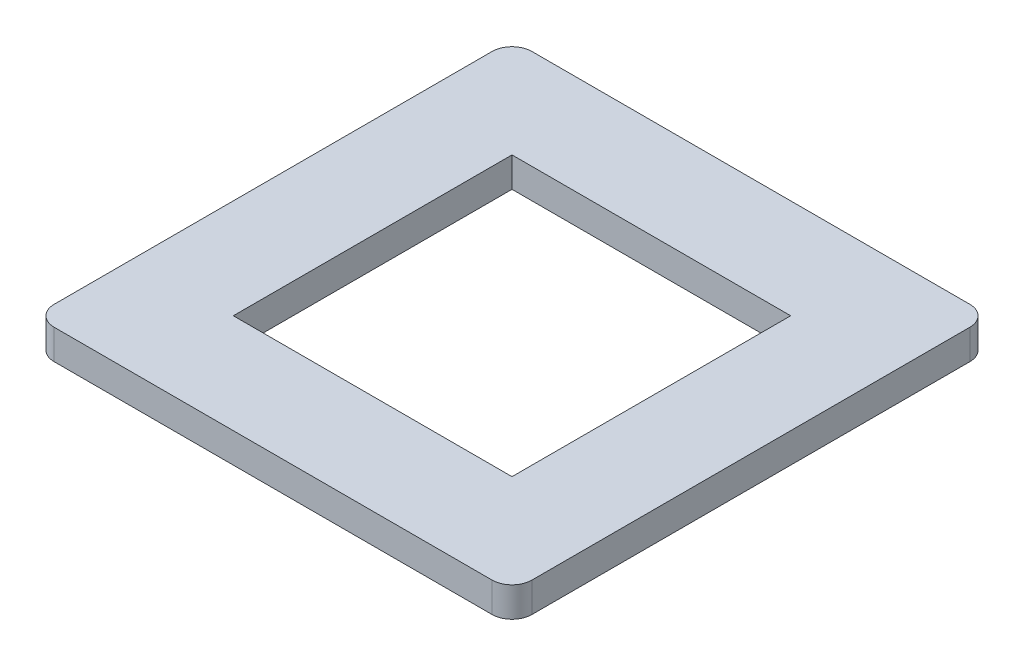
ISO-10303-21;
HEADER;
FILE_DESCRIPTION(('STEP AP214'),'2;1');
FILE_NAME('part.step','',(''),(''),'','','');
FILE_SCHEMA(('AUTOMOTIVE_DESIGN { 1 0 10303 214 1 1 1 1 }'));
ENDSEC;
DATA;
#1=APPLICATION_CONTEXT('core data for automotive mechanical design processes');
#2=APPLICATION_PROTOCOL_DEFINITION('international standard','automotive_design',2000,#1);
#3=PRODUCT_CONTEXT('',#1,'mechanical');
#4=PRODUCT('Part','Part','',(#3));
#5=PRODUCT_RELATED_PRODUCT_CATEGORY('part','',(#4));
#6=PRODUCT_DEFINITION_FORMATION('','',#4);
#7=PRODUCT_DEFINITION_CONTEXT('part definition',#1,'design');
#8=PRODUCT_DEFINITION('design','',#6,#7);
#9=PRODUCT_DEFINITION_SHAPE('','',#8);
#10=(LENGTH_UNIT() NAMED_UNIT(*) SI_UNIT(.MILLI.,.METRE.));
#11=(NAMED_UNIT(*) PLANE_ANGLE_UNIT() SI_UNIT($,.RADIAN.));
#12=(NAMED_UNIT(*) SI_UNIT($,.STERADIAN.) SOLID_ANGLE_UNIT());
#13=UNCERTAINTY_MEASURE_WITH_UNIT(LENGTH_MEASURE(1.E-05),#10,'distance_accuracy_value','');
#14=(GEOMETRIC_REPRESENTATION_CONTEXT(3) GLOBAL_UNCERTAINTY_ASSIGNED_CONTEXT((#13)) GLOBAL_UNIT_ASSIGNED_CONTEXT((#10,
#11,#12)) REPRESENTATION_CONTEXT('',''));
#15=CARTESIAN_POINT('',(0.,0.,0.));
#16=DIRECTION('',(0.,0.,1.));
#17=DIRECTION('',(1.,0.,0.));
#18=AXIS2_PLACEMENT_3D('',#15,#16,#17);
#19=CARTESIAN_POINT('',(0.,1.5,0.));
#20=DIRECTION('',(0.,1.,0.));
#21=DIRECTION('',(0.,0.,1.));
#22=AXIS2_PLACEMENT_3D('',#19,#20,#21);
#23=PLANE('',#22);
#24=DIRECTION('',(1.,0.,0.));
#25=VECTOR('',#24,1.);
#26=CARTESIAN_POINT('',(-12.,1.5,12.));
#27=LINE('',#26,#25);
#28=CARTESIAN_POINT('',(-11.,1.5,12.));
#29=VERTEX_POINT('',#28);
#30=CARTESIAN_POINT('',(11.,1.5,12.));
#31=VERTEX_POINT('',#30);
#32=EDGE_CURVE('E191',#29,#31,#27,.T.);
#33=ORIENTED_EDGE('',*,*,#32,.T.);
#34=CARTESIAN_POINT('',(11.,1.5,11.));
#35=DIRECTION('',(0.,1.,0.));
#36=DIRECTION('',(0.,0.,1.));
#37=AXIS2_PLACEMENT_3D('',#34,#35,#36);
#38=CIRCLE('',#37,1.);
#39=CARTESIAN_POINT('',(12.,1.5,11.));
#40=VERTEX_POINT('',#39);
#41=EDGE_CURVE('E205',#31,#40,#38,.T.);
#42=ORIENTED_EDGE('',*,*,#41,.T.);
#43=DIRECTION('',(0.,0.,-1.));
#44=VECTOR('',#43,1.);
#45=CARTESIAN_POINT('',(12.,1.5,12.));
#46=LINE('',#45,#44);
#47=CARTESIAN_POINT('',(12.,1.5,-11.));
#48=VERTEX_POINT('',#47);
#49=EDGE_CURVE('E196',#40,#48,#46,.T.);
#50=ORIENTED_EDGE('',*,*,#49,.T.);
#51=CARTESIAN_POINT('',(11.,1.5,-11.));
#52=DIRECTION('',(0.,1.,0.));
#53=DIRECTION('',(0.,0.,1.));
#54=AXIS2_PLACEMENT_3D('',#51,#52,#53);
#55=CIRCLE('',#54,1.);
#56=CARTESIAN_POINT('',(11.,1.5,-12.));
#57=VERTEX_POINT('',#56);
#58=EDGE_CURVE('E211',#48,#57,#55,.T.);
#59=ORIENTED_EDGE('',*,*,#58,.T.);
#60=DIRECTION('',(-1.,0.,0.));
#61=VECTOR('',#60,1.);
#62=CARTESIAN_POINT('',(-12.,1.5,-12.));
#63=LINE('',#62,#61);
#64=CARTESIAN_POINT('',(-11.,1.5,-12.));
#65=VERTEX_POINT('',#64);
#66=EDGE_CURVE('E225',#57,#65,#63,.T.);
#67=ORIENTED_EDGE('',*,*,#66,.T.);
#68=CARTESIAN_POINT('',(-11.,1.5,-11.));
#69=DIRECTION('',(0.,1.,0.));
#70=DIRECTION('',(0.,0.,1.));
#71=AXIS2_PLACEMENT_3D('',#68,#69,#70);
#72=CIRCLE('',#71,1.);
#73=CARTESIAN_POINT('',(-12.,1.5,-11.));
#74=VERTEX_POINT('',#73);
#75=EDGE_CURVE('E67',#65,#74,#72,.T.);
#76=ORIENTED_EDGE('',*,*,#75,.T.);
#77=DIRECTION('',(0.,0.,1.));
#78=VECTOR('',#77,1.);
#79=CARTESIAN_POINT('',(-12.,1.5,12.));
#80=LINE('',#79,#78);
#81=CARTESIAN_POINT('',(-12.,1.5,11.));
#82=VERTEX_POINT('',#81);
#83=EDGE_CURVE('E245',#74,#82,#80,.T.);
#84=ORIENTED_EDGE('',*,*,#83,.T.);
#85=CARTESIAN_POINT('',(-11.,1.5,11.));
#86=DIRECTION('',(0.,1.,0.));
#87=DIRECTION('',(0.,0.,1.));
#88=AXIS2_PLACEMENT_3D('',#85,#86,#87);
#89=CIRCLE('',#88,1.);
#90=EDGE_CURVE('E258',#82,#29,#89,.T.);
#91=ORIENTED_EDGE('',*,*,#90,.T.);
#92=EDGE_LOOP('',(#33,#42,#50,#59,#67,#76,#84,#91));
#93=FACE_BOUND('',#92,.T.);
#94=DIRECTION('',(-1.,0.,0.));
#95=VECTOR('',#94,1.);
#96=CARTESIAN_POINT('',(-7.,1.5,-7.));
#97=LINE('',#96,#95);
#98=CARTESIAN_POINT('',(7.,1.5,-7.));
#99=VERTEX_POINT('',#98);
#100=CARTESIAN_POINT('',(-7.,1.5,-7.));
#101=VERTEX_POINT('',#100);
#102=EDGE_CURVE('E148',#99,#101,#97,.T.);
#103=ORIENTED_EDGE('',*,*,#102,.F.);
#104=DIRECTION('',(0.,0.,-1.));
#105=VECTOR('',#104,1.);
#106=CARTESIAN_POINT('',(7.,1.5,7.));
#107=LINE('',#106,#105);
#108=CARTESIAN_POINT('',(7.,1.5,7.));
#109=VERTEX_POINT('',#108);
#110=EDGE_CURVE('E137',#109,#99,#107,.T.);
#111=ORIENTED_EDGE('',*,*,#110,.F.);
#112=DIRECTION('',(1.,0.,0.));
#113=VECTOR('',#112,1.);
#114=CARTESIAN_POINT('',(-7.,1.5,7.));
#115=LINE('',#114,#113);
#116=CARTESIAN_POINT('',(-7.,1.5,7.));
#117=VERTEX_POINT('',#116);
#118=EDGE_CURVE('E166',#117,#109,#115,.T.);
#119=ORIENTED_EDGE('',*,*,#118,.F.);
#120=DIRECTION('',(0.,0.,1.));
#121=VECTOR('',#120,1.);
#122=CARTESIAN_POINT('',(-7.,1.5,7.));
#123=LINE('',#122,#121);
#124=EDGE_CURVE('E161',#101,#117,#123,.T.);
#125=ORIENTED_EDGE('',*,*,#124,.F.);
#126=EDGE_LOOP('',(#103,#111,#119,#125));
#127=FACE_BOUND('',#126,.T.);
#128=ADVANCED_FACE('F46',(#93,#127),#23,.T.);
#129=CARTESIAN_POINT('',(0.,0.,0.));
#130=DIRECTION('',(0.,1.,0.));
#131=DIRECTION('',(0.,0.,1.));
#132=AXIS2_PLACEMENT_3D('',#129,#130,#131);
#133=PLANE('',#132);
#134=DIRECTION('',(0.,0.,-1.));
#135=VECTOR('',#134,1.);
#136=CARTESIAN_POINT('',(12.,0.,12.));
#137=LINE('',#136,#135);
#138=CARTESIAN_POINT('',(12.,0.,11.));
#139=VERTEX_POINT('',#138);
#140=CARTESIAN_POINT('',(12.,0.,-11.));
#141=VERTEX_POINT('',#140);
#142=EDGE_CURVE('E236',#139,#141,#137,.T.);
#143=ORIENTED_EDGE('',*,*,#142,.F.);
#144=CARTESIAN_POINT('',(11.,0.,11.));
#145=DIRECTION('',(0.,1.,0.));
#146=DIRECTION('',(0.,0.,1.));
#147=AXIS2_PLACEMENT_3D('',#144,#145,#146);
#148=CIRCLE('',#147,1.);
#149=CARTESIAN_POINT('',(11.,0.,12.));
#150=VERTEX_POINT('',#149);
#151=EDGE_CURVE('E252',#139,#150,#148,.F.);
#152=ORIENTED_EDGE('',*,*,#151,.T.);
#153=DIRECTION('',(1.,0.,0.));
#154=VECTOR('',#153,1.);
#155=CARTESIAN_POINT('',(-12.,0.,12.));
#156=LINE('',#155,#154);
#157=CARTESIAN_POINT('',(-11.,0.,12.));
#158=VERTEX_POINT('',#157);
#159=EDGE_CURVE('E156',#158,#150,#156,.T.);
#160=ORIENTED_EDGE('',*,*,#159,.F.);
#161=CARTESIAN_POINT('',(-11.,0.,11.));
#162=DIRECTION('',(0.,1.,0.));
#163=DIRECTION('',(0.,0.,1.));
#164=AXIS2_PLACEMENT_3D('',#161,#162,#163);
#165=CIRCLE('',#164,1.);
#166=CARTESIAN_POINT('',(-12.,0.,11.));
#167=VERTEX_POINT('',#166);
#168=EDGE_CURVE('E248',#158,#167,#165,.F.);
#169=ORIENTED_EDGE('',*,*,#168,.T.);
#170=DIRECTION('',(0.,0.,1.));
#171=VECTOR('',#170,1.);
#172=CARTESIAN_POINT('',(-12.,0.,12.));
#173=LINE('',#172,#171);
#174=CARTESIAN_POINT('',(-12.,0.,-11.));
#175=VERTEX_POINT('',#174);
#176=EDGE_CURVE('E197',#175,#167,#173,.T.);
#177=ORIENTED_EDGE('',*,*,#176,.F.);
#178=CARTESIAN_POINT('',(-11.,0.,-11.));
#179=DIRECTION('',(0.,1.,0.));
#180=DIRECTION('',(0.,0.,1.));
#181=AXIS2_PLACEMENT_3D('',#178,#179,#180);
#182=CIRCLE('',#181,1.);
#183=CARTESIAN_POINT('',(-11.,0.,-12.));
#184=VERTEX_POINT('',#183);
#185=EDGE_CURVE('E235',#175,#184,#182,.F.);
#186=ORIENTED_EDGE('',*,*,#185,.T.);
#187=DIRECTION('',(-1.,0.,0.));
#188=VECTOR('',#187,1.);
#189=CARTESIAN_POINT('',(-12.,0.,-12.));
#190=LINE('',#189,#188);
#191=CARTESIAN_POINT('',(11.,0.,-12.));
#192=VERTEX_POINT('',#191);
#193=EDGE_CURVE('E223',#192,#184,#190,.T.);
#194=ORIENTED_EDGE('',*,*,#193,.F.);
#195=CARTESIAN_POINT('',(11.,0.,-11.));
#196=DIRECTION('',(0.,1.,0.));
#197=DIRECTION('',(0.,0.,1.));
#198=AXIS2_PLACEMENT_3D('',#195,#196,#197);
#199=CIRCLE('',#198,1.);
#200=EDGE_CURVE('E232',#192,#141,#199,.F.);
#201=ORIENTED_EDGE('',*,*,#200,.T.);
#202=EDGE_LOOP('',(#143,#152,#160,#169,#177,#186,#194,#201));
#203=FACE_BOUND('',#202,.T.);
#204=DIRECTION('',(0.,0.,-1.));
#205=VECTOR('',#204,1.);
#206=CARTESIAN_POINT('',(7.,0.,7.));
#207=LINE('',#206,#205);
#208=CARTESIAN_POINT('',(7.,0.,7.));
#209=VERTEX_POINT('',#208);
#210=CARTESIAN_POINT('',(7.,0.,-7.));
#211=VERTEX_POINT('',#210);
#212=EDGE_CURVE('E179',#209,#211,#207,.T.);
#213=ORIENTED_EDGE('',*,*,#212,.T.);
#214=DIRECTION('',(-1.,0.,0.));
#215=VECTOR('',#214,1.);
#216=CARTESIAN_POINT('',(-7.,0.,-7.));
#217=LINE('',#216,#215);
#218=CARTESIAN_POINT('',(-7.,0.,-7.));
#219=VERTEX_POINT('',#218);
#220=EDGE_CURVE('E155',#211,#219,#217,.T.);
#221=ORIENTED_EDGE('',*,*,#220,.T.);
#222=DIRECTION('',(0.,0.,1.));
#223=VECTOR('',#222,1.);
#224=CARTESIAN_POINT('',(-7.,0.,7.));
#225=LINE('',#224,#223);
#226=CARTESIAN_POINT('',(-7.,0.,7.));
#227=VERTEX_POINT('',#226);
#228=EDGE_CURVE('E182',#219,#227,#225,.T.);
#229=ORIENTED_EDGE('',*,*,#228,.T.);
#230=DIRECTION('',(1.,0.,0.));
#231=VECTOR('',#230,1.);
#232=CARTESIAN_POINT('',(-7.,0.,7.));
#233=LINE('',#232,#231);
#234=EDGE_CURVE('E149',#227,#209,#233,.T.);
#235=ORIENTED_EDGE('',*,*,#234,.T.);
#236=EDGE_LOOP('',(#213,#221,#229,#235));
#237=FACE_BOUND('',#236,.T.);
#238=ADVANCED_FACE('F230',(#203,#237),#133,.F.);
#239=CARTESIAN_POINT('',(-12.,1.5,12.));
#240=DIRECTION('',(0.,0.,-1.));
#241=DIRECTION('',(-1.,0.,0.));
#242=AXIS2_PLACEMENT_3D('',#239,#240,#241);
#243=PLANE('',#242);
#244=ORIENTED_EDGE('',*,*,#159,.T.);
#245=DIRECTION('',(0.,-1.,0.));
#246=VECTOR('',#245,1.);
#247=CARTESIAN_POINT('',(11.,1.5,12.));
#248=LINE('',#247,#246);
#249=EDGE_CURVE('E257',#150,#31,#248,.F.);
#250=ORIENTED_EDGE('',*,*,#249,.T.);
#251=ORIENTED_EDGE('',*,*,#32,.F.);
#252=DIRECTION('',(0.,-1.,0.));
#253=VECTOR('',#252,1.);
#254=CARTESIAN_POINT('',(-11.,1.5,12.));
#255=LINE('',#254,#253);
#256=EDGE_CURVE('E254',#29,#158,#255,.T.);
#257=ORIENTED_EDGE('',*,*,#256,.T.);
#258=EDGE_LOOP('',(#244,#250,#251,#257));
#259=FACE_BOUND('',#258,.T.);
#260=ADVANCED_FACE('F272',(#259),#243,.F.);
#261=CARTESIAN_POINT('',(12.,1.5,12.));
#262=DIRECTION('',(-1.,0.,0.));
#263=DIRECTION('',(0.,0.,1.));
#264=AXIS2_PLACEMENT_3D('',#261,#262,#263);
#265=PLANE('',#264);
#266=ORIENTED_EDGE('',*,*,#49,.F.);
#267=DIRECTION('',(0.,-1.,0.));
#268=VECTOR('',#267,1.);
#269=CARTESIAN_POINT('',(12.,1.5,11.));
#270=LINE('',#269,#268);
#271=EDGE_CURVE('E244',#40,#139,#270,.T.);
#272=ORIENTED_EDGE('',*,*,#271,.T.);
#273=ORIENTED_EDGE('',*,*,#142,.T.);
#274=DIRECTION('',(0.,-1.,0.));
#275=VECTOR('',#274,1.);
#276=CARTESIAN_POINT('',(12.,1.5,-11.));
#277=LINE('',#276,#275);
#278=EDGE_CURVE('E242',#141,#48,#277,.F.);
#279=ORIENTED_EDGE('',*,*,#278,.T.);
#280=EDGE_LOOP('',(#266,#272,#273,#279));
#281=FACE_BOUND('',#280,.T.);
#282=ADVANCED_FACE('F282',(#281),#265,.F.);
#283=CARTESIAN_POINT('',(-12.,1.5,-12.));
#284=DIRECTION('',(0.,0.,1.));
#285=DIRECTION('',(1.,0.,0.));
#286=AXIS2_PLACEMENT_3D('',#283,#284,#285);
#287=PLANE('',#286);
#288=ORIENTED_EDGE('',*,*,#66,.F.);
#289=DIRECTION('',(0.,-1.,0.));
#290=VECTOR('',#289,1.);
#291=CARTESIAN_POINT('',(11.,1.5,-12.));
#292=LINE('',#291,#290);
#293=EDGE_CURVE('E215',#57,#192,#292,.T.);
#294=ORIENTED_EDGE('',*,*,#293,.T.);
#295=ORIENTED_EDGE('',*,*,#193,.T.);
#296=DIRECTION('',(0.,-1.,0.));
#297=VECTOR('',#296,1.);
#298=CARTESIAN_POINT('',(-11.,1.5,-12.));
#299=LINE('',#298,#297);
#300=EDGE_CURVE('E210',#184,#65,#299,.F.);
#301=ORIENTED_EDGE('',*,*,#300,.T.);
#302=EDGE_LOOP('',(#288,#294,#295,#301));
#303=FACE_BOUND('',#302,.T.);
#304=ADVANCED_FACE('F222',(#303),#287,.F.);
#305=CARTESIAN_POINT('',(-12.,1.5,12.));
#306=DIRECTION('',(1.,0.,0.));
#307=DIRECTION('',(0.,0.,-1.));
#308=AXIS2_PLACEMENT_3D('',#305,#306,#307);
#309=PLANE('',#308);
#310=ORIENTED_EDGE('',*,*,#83,.F.);
#311=DIRECTION('',(0.,-1.,0.));
#312=VECTOR('',#311,1.);
#313=CARTESIAN_POINT('',(-12.,1.5,-11.));
#314=LINE('',#313,#312);
#315=EDGE_CURVE('E12',#74,#175,#314,.T.);
#316=ORIENTED_EDGE('',*,*,#315,.T.);
#317=ORIENTED_EDGE('',*,*,#176,.T.);
#318=DIRECTION('',(0.,-1.,0.));
#319=VECTOR('',#318,1.);
#320=CARTESIAN_POINT('',(-12.,1.5,11.));
#321=LINE('',#320,#319);
#322=EDGE_CURVE('E54',#167,#82,#321,.F.);
#323=ORIENTED_EDGE('',*,*,#322,.T.);
#324=EDGE_LOOP('',(#310,#316,#317,#323));
#325=FACE_BOUND('',#324,.T.);
#326=ADVANCED_FACE('F290',(#325),#309,.F.);
#327=CARTESIAN_POINT('',(7.,1.5,7.));
#328=DIRECTION('',(-1.,0.,0.));
#329=DIRECTION('',(0.,0.,1.));
#330=AXIS2_PLACEMENT_3D('',#327,#328,#329);
#331=PLANE('',#330);
#332=ORIENTED_EDGE('',*,*,#212,.F.);
#333=DIRECTION('',(0.,-1.,0.));
#334=VECTOR('',#333,1.);
#335=CARTESIAN_POINT('',(7.,1.5,7.));
#336=LINE('',#335,#334);
#337=EDGE_CURVE('E143',#109,#209,#336,.T.);
#338=ORIENTED_EDGE('',*,*,#337,.F.);
#339=ORIENTED_EDGE('',*,*,#110,.T.);
#340=DIRECTION('',(0.,-1.,0.));
#341=VECTOR('',#340,1.);
#342=CARTESIAN_POINT('',(7.,1.5,-7.));
#343=LINE('',#342,#341);
#344=EDGE_CURVE('E140',#99,#211,#343,.T.);
#345=ORIENTED_EDGE('',*,*,#344,.T.);
#346=EDGE_LOOP('',(#332,#338,#339,#345));
#347=FACE_BOUND('',#346,.T.);
#348=ADVANCED_FACE('F139',(#347),#331,.T.);
#349=CARTESIAN_POINT('',(-7.,1.5,-7.));
#350=DIRECTION('',(0.,0.,1.));
#351=DIRECTION('',(1.,0.,0.));
#352=AXIS2_PLACEMENT_3D('',#349,#350,#351);
#353=PLANE('',#352);
#354=ORIENTED_EDGE('',*,*,#220,.F.);
#355=ORIENTED_EDGE('',*,*,#344,.F.);
#356=ORIENTED_EDGE('',*,*,#102,.T.);
#357=DIRECTION('',(0.,-1.,0.));
#358=VECTOR('',#357,1.);
#359=CARTESIAN_POINT('',(-7.,1.5,-7.));
#360=LINE('',#359,#358);
#361=EDGE_CURVE('E157',#101,#219,#360,.T.);
#362=ORIENTED_EDGE('',*,*,#361,.T.);
#363=EDGE_LOOP('',(#354,#355,#356,#362));
#364=FACE_BOUND('',#363,.T.);
#365=ADVANCED_FACE('F152',(#364),#353,.T.);
#366=CARTESIAN_POINT('',(-7.,1.5,7.));
#367=DIRECTION('',(1.,0.,0.));
#368=DIRECTION('',(0.,0.,-1.));
#369=AXIS2_PLACEMENT_3D('',#366,#367,#368);
#370=PLANE('',#369);
#371=ORIENTED_EDGE('',*,*,#228,.F.);
#372=ORIENTED_EDGE('',*,*,#361,.F.);
#373=ORIENTED_EDGE('',*,*,#124,.T.);
#374=DIRECTION('',(0.,-1.,0.));
#375=VECTOR('',#374,1.);
#376=CARTESIAN_POINT('',(-7.,1.5,7.));
#377=LINE('',#376,#375);
#378=EDGE_CURVE('E188',#117,#227,#377,.T.);
#379=ORIENTED_EDGE('',*,*,#378,.T.);
#380=EDGE_LOOP('',(#371,#372,#373,#379));
#381=FACE_BOUND('',#380,.T.);
#382=ADVANCED_FACE('F346',(#381),#370,.T.);
#383=CARTESIAN_POINT('',(-7.,1.5,7.));
#384=DIRECTION('',(0.,0.,-1.));
#385=DIRECTION('',(-1.,0.,0.));
#386=AXIS2_PLACEMENT_3D('',#383,#384,#385);
#387=PLANE('',#386);
#388=ORIENTED_EDGE('',*,*,#234,.F.);
#389=ORIENTED_EDGE('',*,*,#378,.F.);
#390=ORIENTED_EDGE('',*,*,#118,.T.);
#391=ORIENTED_EDGE('',*,*,#337,.T.);
#392=EDGE_LOOP('',(#388,#389,#390,#391));
#393=FACE_BOUND('',#392,.T.);
#394=ADVANCED_FACE('F318',(#393),#387,.T.);
#395=CARTESIAN_POINT('',(11.,1.5,11.));
#396=DIRECTION('',(0.,-1.,0.));
#397=DIRECTION('',(0.,0.,-1.));
#398=AXIS2_PLACEMENT_3D('',#395,#396,#397);
#399=CYLINDRICAL_SURFACE('',#398,1.);
#400=ORIENTED_EDGE('',*,*,#41,.F.);
#401=ORIENTED_EDGE('',*,*,#249,.F.);
#402=ORIENTED_EDGE('',*,*,#151,.F.);
#403=ORIENTED_EDGE('',*,*,#271,.F.);
#404=EDGE_LOOP('',(#400,#401,#402,#403));
#405=FACE_BOUND('',#404,.T.);
#406=ADVANCED_FACE('F277',(#405),#399,.T.);
#407=CARTESIAN_POINT('',(11.,1.5,-11.));
#408=DIRECTION('',(0.,-1.,0.));
#409=DIRECTION('',(0.,0.,-1.));
#410=AXIS2_PLACEMENT_3D('',#407,#408,#409);
#411=CYLINDRICAL_SURFACE('',#410,1.);
#412=ORIENTED_EDGE('',*,*,#58,.F.);
#413=ORIENTED_EDGE('',*,*,#278,.F.);
#414=ORIENTED_EDGE('',*,*,#200,.F.);
#415=ORIENTED_EDGE('',*,*,#293,.F.);
#416=EDGE_LOOP('',(#412,#413,#414,#415));
#417=FACE_BOUND('',#416,.T.);
#418=ADVANCED_FACE('F297',(#417),#411,.T.);
#419=CARTESIAN_POINT('',(-11.,1.5,-11.));
#420=DIRECTION('',(0.,-1.,0.));
#421=DIRECTION('',(0.,0.,-1.));
#422=AXIS2_PLACEMENT_3D('',#419,#420,#421);
#423=CYLINDRICAL_SURFACE('',#422,1.);
#424=ORIENTED_EDGE('',*,*,#75,.F.);
#425=ORIENTED_EDGE('',*,*,#300,.F.);
#426=ORIENTED_EDGE('',*,*,#185,.F.);
#427=ORIENTED_EDGE('',*,*,#315,.F.);
#428=EDGE_LOOP('',(#424,#425,#426,#427));
#429=FACE_BOUND('',#428,.T.);
#430=ADVANCED_FACE('F289',(#429),#423,.T.);
#431=CARTESIAN_POINT('',(-11.,1.5,11.));
#432=DIRECTION('',(0.,-1.,0.));
#433=DIRECTION('',(0.,0.,-1.));
#434=AXIS2_PLACEMENT_3D('',#431,#432,#433);
#435=CYLINDRICAL_SURFACE('',#434,1.);
#436=ORIENTED_EDGE('',*,*,#90,.F.);
#437=ORIENTED_EDGE('',*,*,#322,.F.);
#438=ORIENTED_EDGE('',*,*,#168,.F.);
#439=ORIENTED_EDGE('',*,*,#256,.F.);
#440=EDGE_LOOP('',(#436,#437,#438,#439));
#441=FACE_BOUND('',#440,.T.);
#442=ADVANCED_FACE('F48',(#441),#435,.T.);
#443=CLOSED_SHELL('',(#128,#238,#260,#282,#304,#326,#348,#365,#382,#394,#406,#418,#430,#442));
#444=MANIFOLD_SOLID_BREP('B2',#443);
#445=ADVANCED_BREP_SHAPE_REPRESENTATION('',(#18,#444),#14);
#446=SHAPE_DEFINITION_REPRESENTATION(#9,#445);
ENDSEC;
END-ISO-10303-21;
